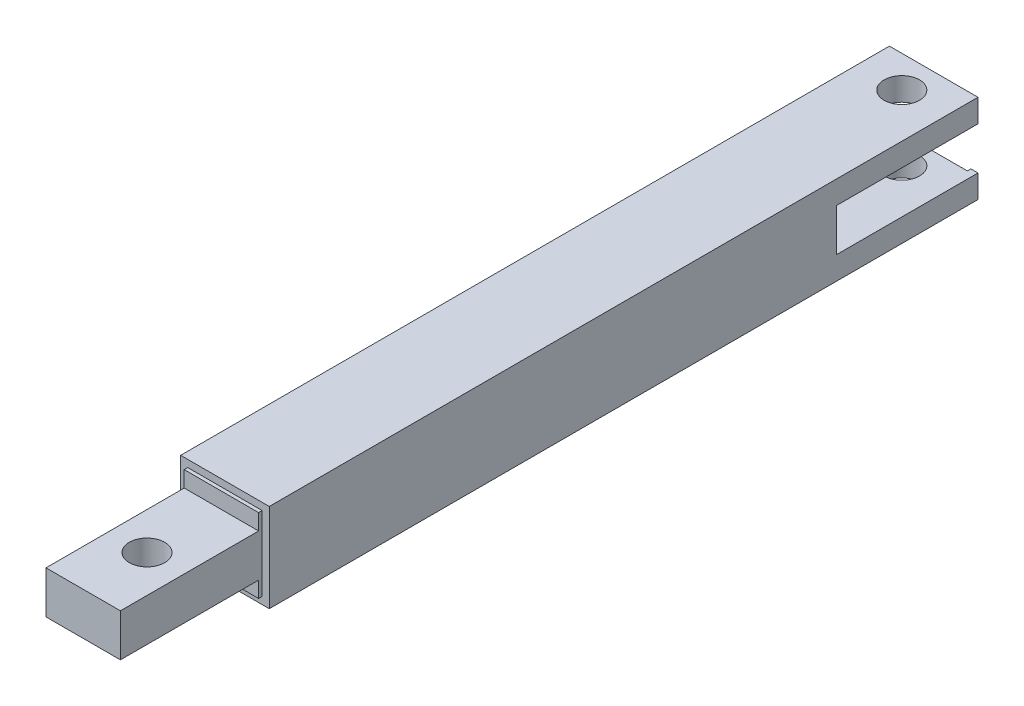
ISO-10303-21;
HEADER;
FILE_DESCRIPTION(('STEP AP214'),'2;1');
FILE_NAME('part.step','',(''),(''),'','','');
FILE_SCHEMA(('AUTOMOTIVE_DESIGN { 1 0 10303 214 1 1 1 1 }'));
ENDSEC;
DATA;
#1=APPLICATION_CONTEXT('core data for automotive mechanical design processes');
#2=APPLICATION_PROTOCOL_DEFINITION('international standard','automotive_design',2000,#1);
#3=PRODUCT_CONTEXT('',#1,'mechanical');
#4=PRODUCT('Part','Part','',(#3));
#5=PRODUCT_RELATED_PRODUCT_CATEGORY('part','',(#4));
#6=PRODUCT_DEFINITION_FORMATION('','',#4);
#7=PRODUCT_DEFINITION_CONTEXT('part definition',#1,'design');
#8=PRODUCT_DEFINITION('design','',#6,#7);
#9=PRODUCT_DEFINITION_SHAPE('','',#8);
#10=(LENGTH_UNIT() NAMED_UNIT(*) SI_UNIT(.MILLI.,.METRE.));
#11=(NAMED_UNIT(*) PLANE_ANGLE_UNIT() SI_UNIT($,.RADIAN.));
#12=(NAMED_UNIT(*) SI_UNIT($,.STERADIAN.) SOLID_ANGLE_UNIT());
#13=UNCERTAINTY_MEASURE_WITH_UNIT(LENGTH_MEASURE(1.E-05),#10,'distance_accuracy_value','');
#14=(GEOMETRIC_REPRESENTATION_CONTEXT(3) GLOBAL_UNCERTAINTY_ASSIGNED_CONTEXT((#13)) GLOBAL_UNIT_ASSIGNED_CONTEXT((#10,
#11,#12)) REPRESENTATION_CONTEXT('',''));
#15=CARTESIAN_POINT('',(0.,0.,0.));
#16=DIRECTION('',(0.,0.,1.));
#17=DIRECTION('',(1.,0.,0.));
#18=AXIS2_PLACEMENT_3D('',#15,#16,#17);
#19=CARTESIAN_POINT('',(0.,0.,201.));
#20=DIRECTION('',(0.,0.,1.));
#21=DIRECTION('',(1.,0.,0.));
#22=AXIS2_PLACEMENT_3D('',#19,#20,#21);
#23=PLANE('',#22);
#24=DIRECTION('',(0.,1.,0.));
#25=VECTOR('',#24,1.);
#26=CARTESIAN_POINT('',(10.5,0.,201.));
#27=LINE('',#26,#25);
#28=CARTESIAN_POINT('',(10.5,-10.5,201.));
#29=VERTEX_POINT('',#28);
#30=CARTESIAN_POINT('',(10.5,-6.,201.));
#31=VERTEX_POINT('',#30);
#32=EDGE_CURVE('E259',#29,#31,#27,.T.);
#33=ORIENTED_EDGE('',*,*,#32,.T.);
#34=DIRECTION('',(-1.,0.,0.));
#35=VECTOR('',#34,1.);
#36=CARTESIAN_POINT('',(0.,-6.,201.));
#37=LINE('',#36,#35);
#38=CARTESIAN_POINT('',(-10.5,-6.,201.));
#39=VERTEX_POINT('',#38);
#40=EDGE_CURVE('E11',#31,#39,#37,.T.);
#41=ORIENTED_EDGE('',*,*,#40,.T.);
#42=DIRECTION('',(0.,-1.,0.));
#43=VECTOR('',#42,1.);
#44=CARTESIAN_POINT('',(-10.5,0.,201.));
#45=LINE('',#44,#43);
#46=CARTESIAN_POINT('',(-10.5,-10.5,201.));
#47=VERTEX_POINT('',#46);
#48=EDGE_CURVE('E224',#39,#47,#45,.T.);
#49=ORIENTED_EDGE('',*,*,#48,.T.);
#50=DIRECTION('',(1.,0.,0.));
#51=VECTOR('',#50,1.);
#52=CARTESIAN_POINT('',(0.,-10.5,201.));
#53=LINE('',#52,#51);
#54=EDGE_CURVE('E256',#47,#29,#53,.T.);
#55=ORIENTED_EDGE('',*,*,#54,.T.);
#56=EDGE_LOOP('',(#33,#41,#49,#55));
#57=FACE_BOUND('',#56,.T.);
#58=ADVANCED_FACE('F39',(#57),#23,.T.);
#59=CARTESIAN_POINT('',(-10.5,10.5,201.));
#60=VERTEX_POINT('',#59);
#61=CARTESIAN_POINT('',(-10.5,6.,201.));
#62=VERTEX_POINT('',#61);
#63=EDGE_CURVE('E253',#60,#62,#45,.T.);
#64=ORIENTED_EDGE('',*,*,#63,.T.);
#65=DIRECTION('',(1.,0.,0.));
#66=VECTOR('',#65,1.);
#67=CARTESIAN_POINT('',(0.,6.,201.));
#68=LINE('',#67,#66);
#69=CARTESIAN_POINT('',(10.5,6.,201.));
#70=VERTEX_POINT('',#69);
#71=EDGE_CURVE('E47',#62,#70,#68,.T.);
#72=ORIENTED_EDGE('',*,*,#71,.T.);
#73=CARTESIAN_POINT('',(10.5,10.5,201.));
#74=VERTEX_POINT('',#73);
#75=EDGE_CURVE('E258',#70,#74,#27,.T.);
#76=ORIENTED_EDGE('',*,*,#75,.T.);
#77=DIRECTION('',(-1.,0.,0.));
#78=VECTOR('',#77,1.);
#79=CARTESIAN_POINT('',(0.,10.5,201.));
#80=LINE('',#79,#78);
#81=EDGE_CURVE('E262',#74,#60,#80,.T.);
#82=ORIENTED_EDGE('',*,*,#81,.T.);
#83=EDGE_LOOP('',(#64,#72,#76,#82));
#84=FACE_BOUND('',#83,.T.);
#85=ADVANCED_FACE('F384',(#84),#23,.T.);
#86=CARTESIAN_POINT('',(0.,-12.5,9.));
#87=DIRECTION('',(0.,1.,0.));
#88=DIRECTION('',(0.,0.,1.));
#89=AXIS2_PLACEMENT_3D('',#86,#87,#88);
#90=CYLINDRICAL_SURFACE('',#89,5.);
#91=CARTESIAN_POINT('',(0.,-6.00000000000001,9.));
#92=DIRECTION('',(0.,-1.,0.));
#93=DIRECTION('',(0.,0.,-1.));
#94=AXIS2_PLACEMENT_3D('',#91,#92,#93);
#95=CIRCLE('',#94,5.);
#96=CARTESIAN_POINT('',(0.,-6.00000000000001,4.));
#97=VERTEX_POINT('',#96);
#98=EDGE_CURVE('E236',#97,#97,#95,.F.);
#99=ORIENTED_EDGE('',*,*,#98,.T.);
#100=EDGE_LOOP('',(#99));
#101=FACE_BOUND('',#100,.T.);
#102=CARTESIAN_POINT('',(0.,-12.5,9.));
#103=DIRECTION('',(0.,1.,0.));
#104=DIRECTION('',(0.,0.,1.));
#105=AXIS2_PLACEMENT_3D('',#102,#103,#104);
#106=CIRCLE('',#105,5.);
#107=CARTESIAN_POINT('',(0.,-12.5,14.));
#108=VERTEX_POINT('',#107);
#109=EDGE_CURVE('E277',#108,#108,#106,.T.);
#110=ORIENTED_EDGE('',*,*,#109,.F.);
#111=EDGE_LOOP('',(#110));
#112=FACE_BOUND('',#111,.T.);
#113=ADVANCED_FACE('F424',(#101,#112),#90,.F.);
#114=CARTESIAN_POINT('',(0.,0.,1.));
#115=DIRECTION('',(0.,0.,1.));
#116=DIRECTION('',(1.,0.,0.));
#117=AXIS2_PLACEMENT_3D('',#114,#115,#116);
#118=PLANE('',#117);
#119=DIRECTION('',(0.,-1.,0.));
#120=VECTOR('',#119,1.);
#121=CARTESIAN_POINT('',(-10.5,0.,1.));
#122=LINE('',#121,#120);
#123=CARTESIAN_POINT('',(-10.5,-6.00000000000001,1.));
#124=VERTEX_POINT('',#123);
#125=CARTESIAN_POINT('',(-10.5,-10.5,1.));
#126=VERTEX_POINT('',#125);
#127=EDGE_CURVE('E239',#124,#126,#122,.T.);
#128=ORIENTED_EDGE('',*,*,#127,.F.);
#129=DIRECTION('',(-1.,0.,0.));
#130=VECTOR('',#129,1.);
#131=CARTESIAN_POINT('',(10.5,-6.00000000000001,1.));
#132=LINE('',#131,#130);
#133=CARTESIAN_POINT('',(10.5,-6.00000000000001,1.));
#134=VERTEX_POINT('',#133);
#135=EDGE_CURVE('E225',#134,#124,#132,.T.);
#136=ORIENTED_EDGE('',*,*,#135,.F.);
#137=DIRECTION('',(0.,1.,0.));
#138=VECTOR('',#137,1.);
#139=CARTESIAN_POINT('',(10.5,0.,1.));
#140=LINE('',#139,#138);
#141=CARTESIAN_POINT('',(10.5,-10.5,1.));
#142=VERTEX_POINT('',#141);
#143=EDGE_CURVE('E247',#142,#134,#140,.T.);
#144=ORIENTED_EDGE('',*,*,#143,.F.);
#145=DIRECTION('',(1.,0.,0.));
#146=VECTOR('',#145,1.);
#147=CARTESIAN_POINT('',(0.,-10.5,1.));
#148=LINE('',#147,#146);
#149=EDGE_CURVE('E243',#126,#142,#148,.T.);
#150=ORIENTED_EDGE('',*,*,#149,.F.);
#151=EDGE_LOOP('',(#128,#136,#144,#150));
#152=FACE_BOUND('',#151,.T.);
#153=ADVANCED_FACE('F472',(#152),#118,.F.);
#154=CARTESIAN_POINT('',(-10.5,10.5,200.));
#155=DIRECTION('',(1.,0.,0.));
#156=DIRECTION('',(0.,0.,-1.));
#157=AXIS2_PLACEMENT_3D('',#154,#155,#156);
#158=PLANE('',#157);
#159=DIRECTION('',(0.,0.,-1.));
#160=VECTOR('',#159,1.);
#161=CARTESIAN_POINT('',(-10.5,10.5,200.));
#162=LINE('',#161,#160);
#163=CARTESIAN_POINT('',(-10.5,10.5,1.));
#164=VERTEX_POINT('',#163);
#165=CARTESIAN_POINT('',(-10.5,10.5,0.));
#166=VERTEX_POINT('',#165);
#167=EDGE_CURVE('E325',#164,#166,#162,.T.);
#168=ORIENTED_EDGE('',*,*,#167,.F.);
#169=CARTESIAN_POINT('',(-10.5,5.99999999999999,1.));
#170=VERTEX_POINT('',#169);
#171=EDGE_CURVE('E240',#164,#170,#122,.T.);
#172=ORIENTED_EDGE('',*,*,#171,.T.);
#173=DIRECTION('',(0.,0.,1.));
#174=VECTOR('',#173,1.);
#175=CARTESIAN_POINT('',(-10.5,5.99999999999998,200.));
#176=LINE('',#175,#174);
#177=CARTESIAN_POINT('',(-10.5,5.99999999999999,0.));
#178=VERTEX_POINT('',#177);
#179=EDGE_CURVE('E303',#178,#170,#176,.T.);
#180=ORIENTED_EDGE('',*,*,#179,.F.);
#181=DIRECTION('',(0.,-1.,0.));
#182=VECTOR('',#181,1.);
#183=CARTESIAN_POINT('',(-10.5,10.5,0.));
#184=LINE('',#183,#182);
#185=EDGE_CURVE('E326',#166,#178,#184,.T.);
#186=ORIENTED_EDGE('',*,*,#185,.F.);
#187=EDGE_LOOP('',(#168,#172,#180,#186));
#188=FACE_BOUND('',#187,.T.);
#189=ADVANCED_FACE('F469',(#188),#158,.T.);
#190=DIRECTION('',(0.,0.,-1.));
#191=VECTOR('',#190,1.);
#192=CARTESIAN_POINT('',(-10.5,-6.00000000000003,200.));
#193=LINE('',#192,#191);
#194=CARTESIAN_POINT('',(-10.5,-6.,0.));
#195=VERTEX_POINT('',#194);
#196=EDGE_CURVE('E311',#124,#195,#193,.T.);
#197=ORIENTED_EDGE('',*,*,#196,.F.);
#198=ORIENTED_EDGE('',*,*,#127,.T.);
#199=DIRECTION('',(0.,0.,-1.));
#200=VECTOR('',#199,1.);
#201=CARTESIAN_POINT('',(-10.5,-10.5,200.));
#202=LINE('',#201,#200);
#203=CARTESIAN_POINT('',(-10.5,-10.5,0.));
#204=VERTEX_POINT('',#203);
#205=EDGE_CURVE('E343',#126,#204,#202,.T.);
#206=ORIENTED_EDGE('',*,*,#205,.T.);
#207=EDGE_CURVE('E313',#195,#204,#184,.T.);
#208=ORIENTED_EDGE('',*,*,#207,.F.);
#209=EDGE_LOOP('',(#197,#198,#206,#208));
#210=FACE_BOUND('',#209,.T.);
#211=ADVANCED_FACE('F467',(#210),#158,.T.);
#212=CARTESIAN_POINT('',(-10.5,-10.5,200.));
#213=DIRECTION('',(0.,1.,0.));
#214=DIRECTION('',(-1.,0.,0.));
#215=AXIS2_PLACEMENT_3D('',#212,#213,#214);
#216=PLANE('',#215);
#217=ORIENTED_EDGE('',*,*,#205,.F.);
#218=ORIENTED_EDGE('',*,*,#149,.T.);
#219=DIRECTION('',(0.,0.,-1.));
#220=VECTOR('',#219,1.);
#221=CARTESIAN_POINT('',(10.5,-10.5,200.));
#222=LINE('',#221,#220);
#223=CARTESIAN_POINT('',(10.5,-10.5,0.));
#224=VERTEX_POINT('',#223);
#225=EDGE_CURVE('E341',#142,#224,#222,.T.);
#226=ORIENTED_EDGE('',*,*,#225,.T.);
#227=DIRECTION('',(1.,0.,0.));
#228=VECTOR('',#227,1.);
#229=CARTESIAN_POINT('',(-10.5,-10.5,0.));
#230=LINE('',#229,#228);
#231=EDGE_CURVE('E329',#204,#224,#230,.T.);
#232=ORIENTED_EDGE('',*,*,#231,.F.);
#233=EDGE_LOOP('',(#217,#218,#226,#232));
#234=FACE_BOUND('',#233,.T.);
#235=ADVANCED_FACE('F463',(#234),#216,.T.);
#236=CARTESIAN_POINT('',(10.5,10.5,200.));
#237=DIRECTION('',(-1.,0.,0.));
#238=DIRECTION('',(0.,0.,1.));
#239=AXIS2_PLACEMENT_3D('',#236,#237,#238);
#240=PLANE('',#239);
#241=ORIENTED_EDGE('',*,*,#225,.F.);
#242=ORIENTED_EDGE('',*,*,#143,.T.);
#243=DIRECTION('',(0.,0.,1.));
#244=VECTOR('',#243,1.);
#245=CARTESIAN_POINT('',(10.5,-6.00000000000003,200.));
#246=LINE('',#245,#244);
#247=CARTESIAN_POINT('',(10.5,-6.,0.));
#248=VERTEX_POINT('',#247);
#249=EDGE_CURVE('E380',#248,#134,#246,.T.);
#250=ORIENTED_EDGE('',*,*,#249,.F.);
#251=DIRECTION('',(0.,1.,0.));
#252=VECTOR('',#251,1.);
#253=CARTESIAN_POINT('',(10.5,10.5,0.));
#254=LINE('',#253,#252);
#255=EDGE_CURVE('E333',#224,#248,#254,.T.);
#256=ORIENTED_EDGE('',*,*,#255,.F.);
#257=EDGE_LOOP('',(#241,#242,#250,#256));
#258=FACE_BOUND('',#257,.T.);
#259=ADVANCED_FACE('F460',(#258),#240,.T.);
#260=DIRECTION('',(0.,0.,-1.));
#261=VECTOR('',#260,1.);
#262=CARTESIAN_POINT('',(10.5,5.99999999999998,200.));
#263=LINE('',#262,#261);
#264=CARTESIAN_POINT('',(10.5,6.,1.));
#265=VERTEX_POINT('',#264);
#266=CARTESIAN_POINT('',(10.5,6.,0.));
#267=VERTEX_POINT('',#266);
#268=EDGE_CURVE('E378',#265,#267,#263,.T.);
#269=ORIENTED_EDGE('',*,*,#268,.F.);
#270=CARTESIAN_POINT('',(10.5,10.5,1.));
#271=VERTEX_POINT('',#270);
#272=EDGE_CURVE('E246',#265,#271,#140,.T.);
#273=ORIENTED_EDGE('',*,*,#272,.T.);
#274=DIRECTION('',(0.,0.,-1.));
#275=VECTOR('',#274,1.);
#276=CARTESIAN_POINT('',(10.5,10.5,200.));
#277=LINE('',#276,#275);
#278=CARTESIAN_POINT('',(10.5,10.5,0.));
#279=VERTEX_POINT('',#278);
#280=EDGE_CURVE('E339',#271,#279,#277,.T.);
#281=ORIENTED_EDGE('',*,*,#280,.T.);
#282=EDGE_CURVE('E332',#267,#279,#254,.T.);
#283=ORIENTED_EDGE('',*,*,#282,.F.);
#284=EDGE_LOOP('',(#269,#273,#281,#283));
#285=FACE_BOUND('',#284,.T.);
#286=ADVANCED_FACE('F458',(#285),#240,.T.);
#287=CARTESIAN_POINT('',(-10.5,10.5,200.));
#288=DIRECTION('',(0.,-1.,0.));
#289=DIRECTION('',(0.,0.,-1.));
#290=AXIS2_PLACEMENT_3D('',#287,#288,#289);
#291=PLANE('',#290);
#292=ORIENTED_EDGE('',*,*,#280,.F.);
#293=DIRECTION('',(-1.,0.,0.));
#294=VECTOR('',#293,1.);
#295=CARTESIAN_POINT('',(0.,10.5,1.));
#296=LINE('',#295,#294);
#297=EDGE_CURVE('E250',#271,#164,#296,.T.);
#298=ORIENTED_EDGE('',*,*,#297,.T.);
#299=ORIENTED_EDGE('',*,*,#167,.T.);
#300=DIRECTION('',(-1.,0.,0.));
#301=VECTOR('',#300,1.);
#302=CARTESIAN_POINT('',(-10.5,10.5,0.));
#303=LINE('',#302,#301);
#304=EDGE_CURVE('E317',#279,#166,#303,.T.);
#305=ORIENTED_EDGE('',*,*,#304,.F.);
#306=EDGE_LOOP('',(#292,#298,#299,#305));
#307=FACE_BOUND('',#306,.T.);
#308=ADVANCED_FACE('F454',(#307),#291,.T.);
#309=CARTESIAN_POINT('',(0.,0.,0.));
#310=DIRECTION('',(0.,0.,1.));
#311=DIRECTION('',(1.,0.,0.));
#312=AXIS2_PLACEMENT_3D('',#309,#310,#311);
#313=PLANE('',#312);
#314=DIRECTION('',(0.,-1.,0.));
#315=VECTOR('',#314,1.);
#316=CARTESIAN_POINT('',(-12.5,12.5,0.));
#317=LINE('',#316,#315);
#318=CARTESIAN_POINT('',(-12.5,-6.,0.));
#319=VERTEX_POINT('',#318);
#320=CARTESIAN_POINT('',(-12.5,-12.5,0.));
#321=VERTEX_POINT('',#320);
#322=EDGE_CURVE('E362',#319,#321,#317,.T.);
#323=ORIENTED_EDGE('',*,*,#322,.F.);
#324=DIRECTION('',(1.,0.,0.));
#325=VECTOR('',#324,1.);
#326=CARTESIAN_POINT('',(-12.5,-6.,0.));
#327=LINE('',#326,#325);
#328=EDGE_CURVE('E300',#319,#195,#327,.T.);
#329=ORIENTED_EDGE('',*,*,#328,.T.);
#330=ORIENTED_EDGE('',*,*,#207,.T.);
#331=ORIENTED_EDGE('',*,*,#231,.T.);
#332=ORIENTED_EDGE('',*,*,#255,.T.);
#333=CARTESIAN_POINT('',(12.5,-6.,0.));
#334=VERTEX_POINT('',#333);
#335=EDGE_CURVE('E304',#248,#334,#327,.T.);
#336=ORIENTED_EDGE('',*,*,#335,.T.);
#337=DIRECTION('',(0.,1.,0.));
#338=VECTOR('',#337,1.);
#339=CARTESIAN_POINT('',(12.5,12.5,0.));
#340=LINE('',#339,#338);
#341=CARTESIAN_POINT('',(12.5,-12.5,0.));
#342=VERTEX_POINT('',#341);
#343=EDGE_CURVE('E357',#342,#334,#340,.T.);
#344=ORIENTED_EDGE('',*,*,#343,.F.);
#345=DIRECTION('',(1.,0.,0.));
#346=VECTOR('',#345,1.);
#347=CARTESIAN_POINT('',(-12.5,-12.5,0.));
#348=LINE('',#347,#346);
#349=EDGE_CURVE('E350',#321,#342,#348,.T.);
#350=ORIENTED_EDGE('',*,*,#349,.F.);
#351=EDGE_LOOP('',(#323,#329,#330,#331,#332,#336,#344,#350));
#352=FACE_BOUND('',#351,.T.);
#353=ADVANCED_FACE('F457',(#352),#313,.F.);
#354=CARTESIAN_POINT('',(0.,0.,200.));
#355=DIRECTION('',(0.,0.,1.));
#356=DIRECTION('',(1.,0.,0.));
#357=AXIS2_PLACEMENT_3D('',#354,#355,#356);
#358=PLANE('',#357);
#359=DIRECTION('',(0.,1.,0.));
#360=VECTOR('',#359,1.);
#361=CARTESIAN_POINT('',(12.5,12.5,200.));
#362=LINE('',#361,#360);
#363=CARTESIAN_POINT('',(12.5,-12.5,200.));
#364=VERTEX_POINT('',#363);
#365=CARTESIAN_POINT('',(12.5,12.5,200.));
#366=VERTEX_POINT('',#365);
#367=EDGE_CURVE('E346',#364,#366,#362,.T.);
#368=ORIENTED_EDGE('',*,*,#367,.T.);
#369=DIRECTION('',(-1.,0.,0.));
#370=VECTOR('',#369,1.);
#371=CARTESIAN_POINT('',(-12.5,12.5,200.));
#372=LINE('',#371,#370);
#373=CARTESIAN_POINT('',(-12.5,12.5,200.));
#374=VERTEX_POINT('',#373);
#375=EDGE_CURVE('E349',#366,#374,#372,.T.);
#376=ORIENTED_EDGE('',*,*,#375,.T.);
#377=DIRECTION('',(0.,-1.,0.));
#378=VECTOR('',#377,1.);
#379=CARTESIAN_POINT('',(-12.5,12.5,200.));
#380=LINE('',#379,#378);
#381=CARTESIAN_POINT('',(-12.5,-12.5,200.));
#382=VERTEX_POINT('',#381);
#383=EDGE_CURVE('E352',#374,#382,#380,.T.);
#384=ORIENTED_EDGE('',*,*,#383,.T.);
#385=DIRECTION('',(1.,0.,0.));
#386=VECTOR('',#385,1.);
#387=CARTESIAN_POINT('',(-12.5,-12.5,200.));
#388=LINE('',#387,#386);
#389=EDGE_CURVE('E354',#382,#364,#388,.T.);
#390=ORIENTED_EDGE('',*,*,#389,.T.);
#391=EDGE_LOOP('',(#368,#376,#384,#390));
#392=FACE_BOUND('',#391,.T.);
#393=DIRECTION('',(1.,0.,0.));
#394=VECTOR('',#393,1.);
#395=CARTESIAN_POINT('',(-10.5,-10.5,200.));
#396=LINE('',#395,#394);
#397=CARTESIAN_POINT('',(-10.5,-10.5,200.));
#398=VERTEX_POINT('',#397);
#399=CARTESIAN_POINT('',(10.5,-10.5,200.));
#400=VERTEX_POINT('',#399);
#401=EDGE_CURVE('E316',#398,#400,#396,.T.);
#402=ORIENTED_EDGE('',*,*,#401,.F.);
#403=DIRECTION('',(0.,-1.,0.));
#404=VECTOR('',#403,1.);
#405=CARTESIAN_POINT('',(-10.5,10.5,200.));
#406=LINE('',#405,#404);
#407=CARTESIAN_POINT('',(-10.5,10.5,200.));
#408=VERTEX_POINT('',#407);
#409=EDGE_CURVE('E314',#408,#398,#406,.T.);
#410=ORIENTED_EDGE('',*,*,#409,.F.);
#411=DIRECTION('',(-1.,0.,0.));
#412=VECTOR('',#411,1.);
#413=CARTESIAN_POINT('',(-10.5,10.5,200.));
#414=LINE('',#413,#412);
#415=CARTESIAN_POINT('',(10.5,10.5,200.));
#416=VERTEX_POINT('',#415);
#417=EDGE_CURVE('E322',#416,#408,#414,.T.);
#418=ORIENTED_EDGE('',*,*,#417,.F.);
#419=DIRECTION('',(0.,1.,0.));
#420=VECTOR('',#419,1.);
#421=CARTESIAN_POINT('',(10.5,10.5,200.));
#422=LINE('',#421,#420);
#423=EDGE_CURVE('E320',#400,#416,#422,.T.);
#424=ORIENTED_EDGE('',*,*,#423,.F.);
#425=EDGE_LOOP('',(#402,#410,#418,#424));
#426=FACE_BOUND('',#425,.T.);
#427=ADVANCED_FACE('F474',(#392,#426),#358,.T.);
#428=CARTESIAN_POINT('',(12.5,6.,0.));
#429=VERTEX_POINT('',#428);
#430=CARTESIAN_POINT('',(12.5,12.5,0.));
#431=VERTEX_POINT('',#430);
#432=EDGE_CURVE('E345',#429,#431,#340,.T.);
#433=ORIENTED_EDGE('',*,*,#432,.F.);
#434=DIRECTION('',(1.,0.,0.));
#435=VECTOR('',#434,1.);
#436=CARTESIAN_POINT('',(-12.5,6.,0.));
#437=LINE('',#436,#435);
#438=EDGE_CURVE('E293',#267,#429,#437,.T.);
#439=ORIENTED_EDGE('',*,*,#438,.F.);
#440=ORIENTED_EDGE('',*,*,#282,.T.);
#441=ORIENTED_EDGE('',*,*,#304,.T.);
#442=ORIENTED_EDGE('',*,*,#185,.T.);
#443=CARTESIAN_POINT('',(-12.5,6.,0.));
#444=VERTEX_POINT('',#443);
#445=EDGE_CURVE('E62',#444,#178,#437,.T.);
#446=ORIENTED_EDGE('',*,*,#445,.F.);
#447=CARTESIAN_POINT('',(-12.5,12.5,0.));
#448=VERTEX_POINT('',#447);
#449=EDGE_CURVE('E363',#448,#444,#317,.T.);
#450=ORIENTED_EDGE('',*,*,#449,.F.);
#451=DIRECTION('',(-1.,0.,0.));
#452=VECTOR('',#451,1.);
#453=CARTESIAN_POINT('',(-12.5,12.5,0.));
#454=LINE('',#453,#452);
#455=EDGE_CURVE('E360',#431,#448,#454,.T.);
#456=ORIENTED_EDGE('',*,*,#455,.F.);
#457=EDGE_LOOP('',(#433,#439,#440,#441,#442,#446,#450,#456));
#458=FACE_BOUND('',#457,.T.);
#459=ADVANCED_FACE('F477',(#458),#313,.F.);
#460=CARTESIAN_POINT('',(12.5,12.5,200.));
#461=DIRECTION('',(-1.,0.,0.));
#462=DIRECTION('',(0.,-1.,0.));
#463=AXIS2_PLACEMENT_3D('',#460,#461,#462);
#464=PLANE('',#463);
#465=ORIENTED_EDGE('',*,*,#343,.T.);
#466=DIRECTION('',(0.,0.,-1.));
#467=VECTOR('',#466,1.);
#468=CARTESIAN_POINT('',(12.5,-6.,0.));
#469=LINE('',#468,#467);
#470=CARTESIAN_POINT('',(12.5,-6.,40.));
#471=VERTEX_POINT('',#470);
#472=EDGE_CURVE('E287',#471,#334,#469,.T.);
#473=ORIENTED_EDGE('',*,*,#472,.F.);
#474=DIRECTION('',(0.,-1.,0.));
#475=VECTOR('',#474,1.);
#476=CARTESIAN_POINT('',(12.5,-6.,40.));
#477=LINE('',#476,#475);
#478=CARTESIAN_POINT('',(12.5,6.,40.));
#479=VERTEX_POINT('',#478);
#480=EDGE_CURVE('E296',#479,#471,#477,.T.);
#481=ORIENTED_EDGE('',*,*,#480,.F.);
#482=DIRECTION('',(0.,0.,1.));
#483=VECTOR('',#482,1.);
#484=CARTESIAN_POINT('',(12.5,6.,0.));
#485=LINE('',#484,#483);
#486=EDGE_CURVE('E280',#429,#479,#485,.T.);
#487=ORIENTED_EDGE('',*,*,#486,.F.);
#488=ORIENTED_EDGE('',*,*,#432,.T.);
#489=DIRECTION('',(0.,0.,-1.));
#490=VECTOR('',#489,1.);
#491=CARTESIAN_POINT('',(12.5,12.5,200.));
#492=LINE('',#491,#490);
#493=EDGE_CURVE('E375',#366,#431,#492,.T.);
#494=ORIENTED_EDGE('',*,*,#493,.F.);
#495=ORIENTED_EDGE('',*,*,#367,.F.);
#496=DIRECTION('',(0.,0.,-1.));
#497=VECTOR('',#496,1.);
#498=CARTESIAN_POINT('',(12.5,-12.5,200.));
#499=LINE('',#498,#497);
#500=EDGE_CURVE('E356',#364,#342,#499,.T.);
#501=ORIENTED_EDGE('',*,*,#500,.T.);
#502=EDGE_LOOP('',(#465,#473,#481,#487,#488,#494,#495,#501));
#503=FACE_BOUND('',#502,.T.);
#504=ADVANCED_FACE('F41',(#503),#464,.F.);
#505=CARTESIAN_POINT('',(-12.5,12.5,200.));
#506=DIRECTION('',(0.,-1.,0.));
#507=DIRECTION('',(0.,0.,-1.));
#508=AXIS2_PLACEMENT_3D('',#505,#506,#507);
#509=PLANE('',#508);
#510=CARTESIAN_POINT('',(0.,12.5,9.));
#511=DIRECTION('',(0.,1.,0.));
#512=DIRECTION('',(0.,0.,1.));
#513=AXIS2_PLACEMENT_3D('',#510,#511,#512);
#514=CIRCLE('',#513,5.);
#515=CARTESIAN_POINT('',(0.,12.5,14.));
#516=VERTEX_POINT('',#515);
#517=EDGE_CURVE('E276',#516,#516,#514,.T.);
#518=ORIENTED_EDGE('',*,*,#517,.F.);
#519=EDGE_LOOP('',(#518));
#520=FACE_BOUND('',#519,.T.);
#521=ORIENTED_EDGE('',*,*,#455,.T.);
#522=DIRECTION('',(0.,0.,-1.));
#523=VECTOR('',#522,1.);
#524=CARTESIAN_POINT('',(-12.5,12.5,200.));
#525=LINE('',#524,#523);
#526=EDGE_CURVE('E372',#374,#448,#525,.T.);
#527=ORIENTED_EDGE('',*,*,#526,.F.);
#528=ORIENTED_EDGE('',*,*,#375,.F.);
#529=ORIENTED_EDGE('',*,*,#493,.T.);
#530=EDGE_LOOP('',(#521,#527,#528,#529));
#531=FACE_BOUND('',#530,.T.);
#532=ADVANCED_FACE('F487',(#520,#531),#509,.F.);
#533=CARTESIAN_POINT('',(-12.5,12.5,200.));
#534=DIRECTION('',(1.,0.,0.));
#535=DIRECTION('',(0.,1.,0.));
#536=AXIS2_PLACEMENT_3D('',#533,#534,#535);
#537=PLANE('',#536);
#538=DIRECTION('',(0.,-1.,0.));
#539=VECTOR('',#538,1.);
#540=CARTESIAN_POINT('',(-12.5,-6.00000000000001,40.));
#541=LINE('',#540,#539);
#542=CARTESIAN_POINT('',(-12.5,5.99999999999999,40.));
#543=VERTEX_POINT('',#542);
#544=CARTESIAN_POINT('',(-12.5,-6.00000000000001,40.));
#545=VERTEX_POINT('',#544);
#546=EDGE_CURVE('E286',#543,#545,#541,.T.);
#547=ORIENTED_EDGE('',*,*,#546,.T.);
#548=DIRECTION('',(0.,0.,-1.));
#549=VECTOR('',#548,1.);
#550=CARTESIAN_POINT('',(-12.5,-6.,0.));
#551=LINE('',#550,#549);
#552=EDGE_CURVE('E290',#545,#319,#551,.T.);
#553=ORIENTED_EDGE('',*,*,#552,.T.);
#554=ORIENTED_EDGE('',*,*,#322,.T.);
#555=DIRECTION('',(0.,0.,-1.));
#556=VECTOR('',#555,1.);
#557=CARTESIAN_POINT('',(-12.5,-12.5,200.));
#558=LINE('',#557,#556);
#559=EDGE_CURVE('E369',#382,#321,#558,.T.);
#560=ORIENTED_EDGE('',*,*,#559,.F.);
#561=ORIENTED_EDGE('',*,*,#383,.F.);
#562=ORIENTED_EDGE('',*,*,#526,.T.);
#563=ORIENTED_EDGE('',*,*,#449,.T.);
#564=DIRECTION('',(0.,0.,1.));
#565=VECTOR('',#564,1.);
#566=CARTESIAN_POINT('',(-12.5,6.,0.));
#567=LINE('',#566,#565);
#568=EDGE_CURVE('E283',#444,#543,#567,.T.);
#569=ORIENTED_EDGE('',*,*,#568,.T.);
#570=EDGE_LOOP('',(#547,#553,#554,#560,#561,#562,#563,#569));
#571=FACE_BOUND('',#570,.T.);
#572=ADVANCED_FACE('F484',(#571),#537,.F.);
#573=CARTESIAN_POINT('',(-12.5,-12.5,200.));
#574=DIRECTION('',(0.,1.,0.));
#575=DIRECTION('',(0.,0.,1.));
#576=AXIS2_PLACEMENT_3D('',#573,#574,#575);
#577=PLANE('',#576);
#578=ORIENTED_EDGE('',*,*,#109,.T.);
#579=EDGE_LOOP('',(#578));
#580=FACE_BOUND('',#579,.T.);
#581=ORIENTED_EDGE('',*,*,#349,.T.);
#582=ORIENTED_EDGE('',*,*,#500,.F.);
#583=ORIENTED_EDGE('',*,*,#389,.F.);
#584=ORIENTED_EDGE('',*,*,#559,.T.);
#585=EDGE_LOOP('',(#581,#582,#583,#584));
#586=FACE_BOUND('',#585,.T.);
#587=ADVANCED_FACE('F447',(#580,#586),#577,.F.);
#588=CARTESIAN_POINT('',(-12.5,-6.,0.));
#589=DIRECTION('',(0.,-1.,0.));
#590=DIRECTION('',(1.,0.,0.));
#591=AXIS2_PLACEMENT_3D('',#588,#589,#590);
#592=PLANE('',#591);
#593=DIRECTION('',(1.,0.,0.));
#594=VECTOR('',#593,1.);
#595=CARTESIAN_POINT('',(-12.5,-6.00000000000001,40.));
#596=LINE('',#595,#594);
#597=EDGE_CURVE('E305',#545,#471,#596,.T.);
#598=ORIENTED_EDGE('',*,*,#597,.T.);
#599=ORIENTED_EDGE('',*,*,#472,.T.);
#600=ORIENTED_EDGE('',*,*,#335,.F.);
#601=ORIENTED_EDGE('',*,*,#249,.T.);
#602=ORIENTED_EDGE('',*,*,#135,.T.);
#603=ORIENTED_EDGE('',*,*,#196,.T.);
#604=ORIENTED_EDGE('',*,*,#328,.F.);
#605=ORIENTED_EDGE('',*,*,#552,.F.);
#606=EDGE_LOOP('',(#598,#599,#600,#601,#602,#603,#604,#605));
#607=FACE_BOUND('',#606,.T.);
#608=ORIENTED_EDGE('',*,*,#98,.F.);
#609=EDGE_LOOP('',(#608));
#610=FACE_BOUND('',#609,.T.);
#611=ADVANCED_FACE('F443',(#607,#610),#592,.F.);
#612=CARTESIAN_POINT('',(-12.5,-6.00000000000001,40.));
#613=DIRECTION('',(0.,0.,1.));
#614=DIRECTION('',(1.,0.,0.));
#615=AXIS2_PLACEMENT_3D('',#612,#613,#614);
#616=PLANE('',#615);
#617=DIRECTION('',(1.,0.,0.));
#618=VECTOR('',#617,1.);
#619=CARTESIAN_POINT('',(-12.5,5.99999999999999,40.));
#620=LINE('',#619,#618);
#621=EDGE_CURVE('E307',#543,#479,#620,.T.);
#622=ORIENTED_EDGE('',*,*,#621,.T.);
#623=ORIENTED_EDGE('',*,*,#480,.T.);
#624=ORIENTED_EDGE('',*,*,#597,.F.);
#625=ORIENTED_EDGE('',*,*,#546,.F.);
#626=EDGE_LOOP('',(#622,#623,#624,#625));
#627=FACE_BOUND('',#626,.T.);
#628=ADVANCED_FACE('F446',(#627),#616,.F.);
#629=CARTESIAN_POINT('',(-12.5,6.,0.));
#630=DIRECTION('',(0.,1.,0.));
#631=DIRECTION('',(-1.,0.,0.));
#632=AXIS2_PLACEMENT_3D('',#629,#630,#631);
#633=PLANE('',#632);
#634=ORIENTED_EDGE('',*,*,#179,.T.);
#635=DIRECTION('',(1.,0.,0.));
#636=VECTOR('',#635,1.);
#637=CARTESIAN_POINT('',(10.5,6.,1.));
#638=LINE('',#637,#636);
#639=EDGE_CURVE('E227',#170,#265,#638,.T.);
#640=ORIENTED_EDGE('',*,*,#639,.T.);
#641=ORIENTED_EDGE('',*,*,#268,.T.);
#642=ORIENTED_EDGE('',*,*,#438,.T.);
#643=ORIENTED_EDGE('',*,*,#486,.T.);
#644=ORIENTED_EDGE('',*,*,#621,.F.);
#645=ORIENTED_EDGE('',*,*,#568,.F.);
#646=ORIENTED_EDGE('',*,*,#445,.T.);
#647=EDGE_LOOP('',(#634,#640,#641,#642,#643,#644,#645,#646));
#648=FACE_BOUND('',#647,.T.);
#649=CARTESIAN_POINT('',(0.,6.,9.));
#650=DIRECTION('',(0.,1.,0.));
#651=DIRECTION('',(0.,0.,1.));
#652=AXIS2_PLACEMENT_3D('',#649,#650,#651);
#653=CIRCLE('',#652,5.);
#654=CARTESIAN_POINT('',(0.,6.,14.));
#655=VERTEX_POINT('',#654);
#656=EDGE_CURVE('E232',#655,#655,#653,.F.);
#657=ORIENTED_EDGE('',*,*,#656,.F.);
#658=EDGE_LOOP('',(#657));
#659=FACE_BOUND('',#658,.T.);
#660=ADVANCED_FACE('F441',(#648,#659),#633,.F.);
#661=ORIENTED_EDGE('',*,*,#656,.T.);
#662=EDGE_LOOP('',(#661));
#663=FACE_BOUND('',#662,.T.);
#664=ORIENTED_EDGE('',*,*,#517,.T.);
#665=EDGE_LOOP('',(#664));
#666=FACE_BOUND('',#665,.T.);
#667=ADVANCED_FACE('F438',(#663,#666),#90,.F.);
#668=ORIENTED_EDGE('',*,*,#272,.F.);
#669=ORIENTED_EDGE('',*,*,#639,.F.);
#670=ORIENTED_EDGE('',*,*,#171,.F.);
#671=ORIENTED_EDGE('',*,*,#297,.F.);
#672=EDGE_LOOP('',(#668,#669,#670,#671));
#673=FACE_BOUND('',#672,.T.);
#674=ADVANCED_FACE('F427',(#673),#118,.F.);
#675=CARTESIAN_POINT('',(-10.5,0.,201.));
#676=DIRECTION('',(1.,0.,0.));
#677=DIRECTION('',(0.,0.,-1.));
#678=AXIS2_PLACEMENT_3D('',#675,#676,#677);
#679=PLANE('',#678);
#680=ORIENTED_EDGE('',*,*,#409,.T.);
#681=DIRECTION('',(0.,0.,-1.));
#682=VECTOR('',#681,1.);
#683=CARTESIAN_POINT('',(-10.5,-10.5,201.));
#684=LINE('',#683,#682);
#685=EDGE_CURVE('E273',#47,#398,#684,.T.);
#686=ORIENTED_EDGE('',*,*,#685,.F.);
#687=ORIENTED_EDGE('',*,*,#48,.F.);
#688=DIRECTION('',(0.,0.,-1.));
#689=VECTOR('',#688,1.);
#690=CARTESIAN_POINT('',(-10.5,-6.,240.));
#691=LINE('',#690,#689);
#692=CARTESIAN_POINT('',(-10.5,-6.,240.));
#693=VERTEX_POINT('',#692);
#694=EDGE_CURVE('E205',#693,#39,#691,.T.);
#695=ORIENTED_EDGE('',*,*,#694,.F.);
#696=DIRECTION('',(0.,-1.,0.));
#697=VECTOR('',#696,1.);
#698=CARTESIAN_POINT('',(-10.5,6.,240.));
#699=LINE('',#698,#697);
#700=CARTESIAN_POINT('',(-10.5,6.,240.));
#701=VERTEX_POINT('',#700);
#702=EDGE_CURVE('E211',#701,#693,#699,.T.);
#703=ORIENTED_EDGE('',*,*,#702,.F.);
#704=DIRECTION('',(0.,0.,-1.));
#705=VECTOR('',#704,1.);
#706=CARTESIAN_POINT('',(-10.5,6.,240.));
#707=LINE('',#706,#705);
#708=EDGE_CURVE('E394',#701,#62,#707,.T.);
#709=ORIENTED_EDGE('',*,*,#708,.T.);
#710=ORIENTED_EDGE('',*,*,#63,.F.);
#711=DIRECTION('',(0.,0.,-1.));
#712=VECTOR('',#711,1.);
#713=CARTESIAN_POINT('',(-10.5,10.5,201.));
#714=LINE('',#713,#712);
#715=EDGE_CURVE('E264',#60,#408,#714,.T.);
#716=ORIENTED_EDGE('',*,*,#715,.T.);
#717=EDGE_LOOP('',(#680,#686,#687,#695,#703,#709,#710,#716));
#718=FACE_BOUND('',#717,.T.);
#719=ADVANCED_FACE('F222',(#718),#679,.F.);
#720=CARTESIAN_POINT('',(0.,-10.5,201.));
#721=DIRECTION('',(0.,1.,0.));
#722=DIRECTION('',(-1.,0.,0.));
#723=AXIS2_PLACEMENT_3D('',#720,#721,#722);
#724=PLANE('',#723);
#725=ORIENTED_EDGE('',*,*,#401,.T.);
#726=DIRECTION('',(0.,0.,-1.));
#727=VECTOR('',#726,1.);
#728=CARTESIAN_POINT('',(10.5,-10.5,201.));
#729=LINE('',#728,#727);
#730=EDGE_CURVE('E270',#29,#400,#729,.T.);
#731=ORIENTED_EDGE('',*,*,#730,.F.);
#732=ORIENTED_EDGE('',*,*,#54,.F.);
#733=ORIENTED_EDGE('',*,*,#685,.T.);
#734=EDGE_LOOP('',(#725,#731,#732,#733));
#735=FACE_BOUND('',#734,.T.);
#736=ADVANCED_FACE('F432',(#735),#724,.F.);
#737=CARTESIAN_POINT('',(10.5,0.,201.));
#738=DIRECTION('',(-1.,0.,0.));
#739=DIRECTION('',(0.,0.,1.));
#740=AXIS2_PLACEMENT_3D('',#737,#738,#739);
#741=PLANE('',#740);
#742=ORIENTED_EDGE('',*,*,#423,.T.);
#743=DIRECTION('',(0.,0.,-1.));
#744=VECTOR('',#743,1.);
#745=CARTESIAN_POINT('',(10.5,10.5,201.));
#746=LINE('',#745,#744);
#747=EDGE_CURVE('E267',#74,#416,#746,.T.);
#748=ORIENTED_EDGE('',*,*,#747,.F.);
#749=ORIENTED_EDGE('',*,*,#75,.F.);
#750=DIRECTION('',(0.,0.,-1.));
#751=VECTOR('',#750,1.);
#752=CARTESIAN_POINT('',(10.5,6.,240.));
#753=LINE('',#752,#751);
#754=CARTESIAN_POINT('',(10.5,6.,240.));
#755=VERTEX_POINT('',#754);
#756=EDGE_CURVE('E54',#755,#70,#753,.T.);
#757=ORIENTED_EDGE('',*,*,#756,.F.);
#758=DIRECTION('',(0.,1.,0.));
#759=VECTOR('',#758,1.);
#760=CARTESIAN_POINT('',(10.5,6.,240.));
#761=LINE('',#760,#759);
#762=CARTESIAN_POINT('',(10.5,-6.,240.));
#763=VERTEX_POINT('',#762);
#764=EDGE_CURVE('E210',#763,#755,#761,.T.);
#765=ORIENTED_EDGE('',*,*,#764,.F.);
#766=DIRECTION('',(0.,0.,-1.));
#767=VECTOR('',#766,1.);
#768=CARTESIAN_POINT('',(10.5,-6.,240.));
#769=LINE('',#768,#767);
#770=EDGE_CURVE('E207',#763,#31,#769,.T.);
#771=ORIENTED_EDGE('',*,*,#770,.T.);
#772=ORIENTED_EDGE('',*,*,#32,.F.);
#773=ORIENTED_EDGE('',*,*,#730,.T.);
#774=EDGE_LOOP('',(#742,#748,#749,#757,#765,#771,#772,#773));
#775=FACE_BOUND('',#774,.T.);
#776=ADVANCED_FACE('F388',(#775),#741,.F.);
#777=CARTESIAN_POINT('',(0.,10.5,201.));
#778=DIRECTION('',(0.,-1.,0.));
#779=DIRECTION('',(0.,0.,-1.));
#780=AXIS2_PLACEMENT_3D('',#777,#778,#779);
#781=PLANE('',#780);
#782=ORIENTED_EDGE('',*,*,#417,.T.);
#783=ORIENTED_EDGE('',*,*,#715,.F.);
#784=ORIENTED_EDGE('',*,*,#81,.F.);
#785=ORIENTED_EDGE('',*,*,#747,.T.);
#786=EDGE_LOOP('',(#782,#783,#784,#785));
#787=FACE_BOUND('',#786,.T.);
#788=ADVANCED_FACE('F393',(#787),#781,.F.);
#789=CARTESIAN_POINT('',(-10.5,-6.,240.));
#790=DIRECTION('',(0.,1.,0.));
#791=DIRECTION('',(0.,0.,1.));
#792=AXIS2_PLACEMENT_3D('',#789,#790,#791);
#793=PLANE('',#792);
#794=CARTESIAN_POINT('',(0.,-6.,222.));
#795=DIRECTION('',(0.,1.,0.));
#796=DIRECTION('',(0.,0.,1.));
#797=AXIS2_PLACEMENT_3D('',#794,#795,#796);
#798=CIRCLE('',#797,5.);
#799=CARTESIAN_POINT('',(0.,-6.,227.));
#800=VERTEX_POINT('',#799);
#801=EDGE_CURVE('E219',#800,#800,#798,.T.);
#802=ORIENTED_EDGE('',*,*,#801,.T.);
#803=EDGE_LOOP('',(#802));
#804=FACE_BOUND('',#803,.T.);
#805=ORIENTED_EDGE('',*,*,#40,.F.);
#806=ORIENTED_EDGE('',*,*,#770,.F.);
#807=DIRECTION('',(1.,0.,0.));
#808=VECTOR('',#807,1.);
#809=CARTESIAN_POINT('',(-10.5,-6.,240.));
#810=LINE('',#809,#808);
#811=EDGE_CURVE('E201',#693,#763,#810,.T.);
#812=ORIENTED_EDGE('',*,*,#811,.F.);
#813=ORIENTED_EDGE('',*,*,#694,.T.);
#814=EDGE_LOOP('',(#805,#806,#812,#813));
#815=FACE_BOUND('',#814,.T.);
#816=ADVANCED_FACE('F203',(#804,#815),#793,.F.);
#817=CARTESIAN_POINT('',(-10.5,6.,240.));
#818=DIRECTION('',(0.,-1.,0.));
#819=DIRECTION('',(0.,0.,-1.));
#820=AXIS2_PLACEMENT_3D('',#817,#818,#819);
#821=PLANE('',#820);
#822=CARTESIAN_POINT('',(0.,6.,222.));
#823=DIRECTION('',(0.,1.,0.));
#824=DIRECTION('',(0.,0.,1.));
#825=AXIS2_PLACEMENT_3D('',#822,#823,#824);
#826=CIRCLE('',#825,5.);
#827=CARTESIAN_POINT('',(0.,6.,227.));
#828=VERTEX_POINT('',#827);
#829=EDGE_CURVE('E401',#828,#828,#826,.T.);
#830=ORIENTED_EDGE('',*,*,#829,.F.);
#831=EDGE_LOOP('',(#830));
#832=FACE_BOUND('',#831,.T.);
#833=ORIENTED_EDGE('',*,*,#71,.F.);
#834=ORIENTED_EDGE('',*,*,#708,.F.);
#835=DIRECTION('',(-1.,0.,0.));
#836=VECTOR('',#835,1.);
#837=CARTESIAN_POINT('',(-10.5,6.,240.));
#838=LINE('',#837,#836);
#839=EDGE_CURVE('E215',#755,#701,#838,.T.);
#840=ORIENTED_EDGE('',*,*,#839,.F.);
#841=ORIENTED_EDGE('',*,*,#756,.T.);
#842=EDGE_LOOP('',(#833,#834,#840,#841));
#843=FACE_BOUND('',#842,.T.);
#844=ADVANCED_FACE('F408',(#832,#843),#821,.F.);
#845=CARTESIAN_POINT('',(0.,0.,240.));
#846=DIRECTION('',(0.,0.,1.));
#847=DIRECTION('',(1.,0.,0.));
#848=AXIS2_PLACEMENT_3D('',#845,#846,#847);
#849=PLANE('',#848);
#850=ORIENTED_EDGE('',*,*,#702,.T.);
#851=ORIENTED_EDGE('',*,*,#811,.T.);
#852=ORIENTED_EDGE('',*,*,#764,.T.);
#853=ORIENTED_EDGE('',*,*,#839,.T.);
#854=EDGE_LOOP('',(#850,#851,#852,#853));
#855=FACE_BOUND('',#854,.T.);
#856=ADVANCED_FACE('F214',(#855),#849,.T.);
#857=CARTESIAN_POINT('',(0.,-12.5,222.));
#858=DIRECTION('',(0.,1.,0.));
#859=DIRECTION('',(0.,0.,1.));
#860=AXIS2_PLACEMENT_3D('',#857,#858,#859);
#861=CYLINDRICAL_SURFACE('',#860,5.);
#862=ORIENTED_EDGE('',*,*,#829,.T.);
#863=EDGE_LOOP('',(#862));
#864=FACE_BOUND('',#863,.T.);
#865=ORIENTED_EDGE('',*,*,#801,.F.);
#866=EDGE_LOOP('',(#865));
#867=FACE_BOUND('',#866,.T.);
#868=ADVANCED_FACE('F405',(#864,#867),#861,.F.);
#869=CLOSED_SHELL('',(#58,#85,#113,#153,#189,#211,#235,#259,#286,#308,#353,#427,#459,#504,#532,
#572,#587,#611,#628,#660,#667,#674,#719,#736,#776,#788,#816,#844,#856,#868));
#870=MANIFOLD_SOLID_BREP('B2',#869);
#871=ADVANCED_BREP_SHAPE_REPRESENTATION('',(#18,#870),#14);
#872=SHAPE_DEFINITION_REPRESENTATION(#9,#871);
ENDSEC;
END-ISO-10303-21;
